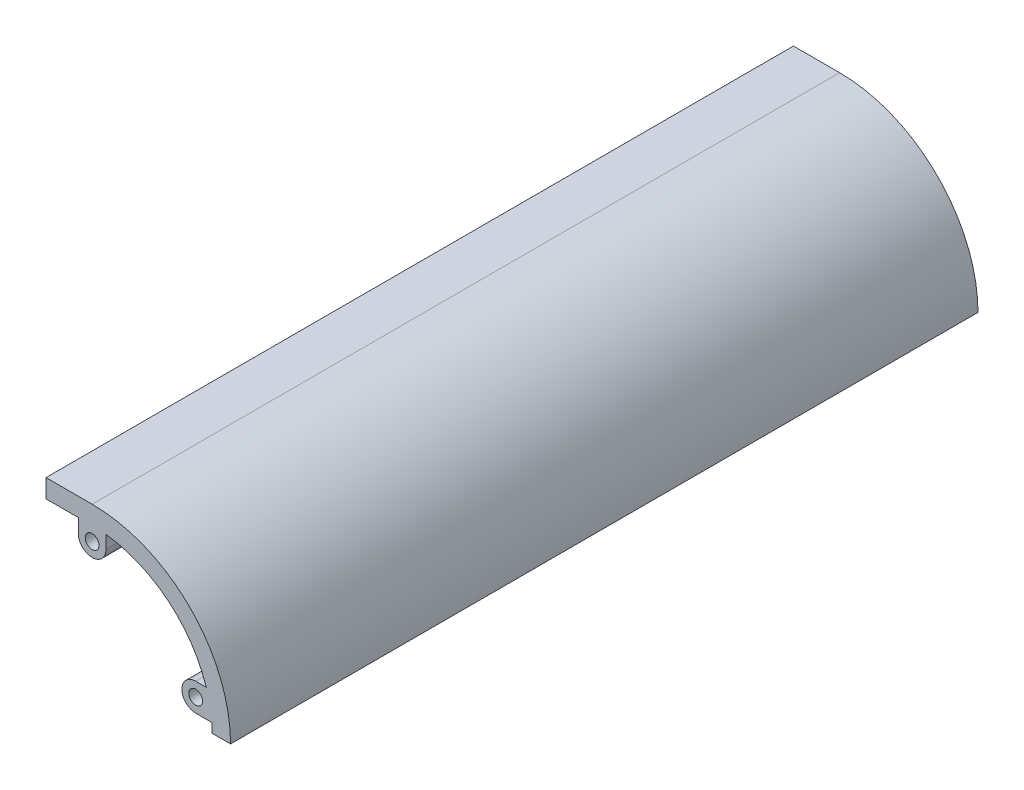
ISO-10303-21;
HEADER;
FILE_DESCRIPTION(('STEP AP214'),'2;1');
FILE_NAME('part.step','',(''),(''),'','','');
FILE_SCHEMA(('AUTOMOTIVE_DESIGN { 1 0 10303 214 1 1 1 1 }'));
ENDSEC;
DATA;
#1=APPLICATION_CONTEXT('core data for automotive mechanical design processes');
#2=APPLICATION_PROTOCOL_DEFINITION('international standard','automotive_design',2000,#1);
#3=PRODUCT_CONTEXT('',#1,'mechanical');
#4=PRODUCT('Part','Part','',(#3));
#5=PRODUCT_RELATED_PRODUCT_CATEGORY('part','',(#4));
#6=PRODUCT_DEFINITION_FORMATION('','',#4);
#7=PRODUCT_DEFINITION_CONTEXT('part definition',#1,'design');
#8=PRODUCT_DEFINITION('design','',#6,#7);
#9=PRODUCT_DEFINITION_SHAPE('','',#8);
#10=(LENGTH_UNIT() NAMED_UNIT(*) SI_UNIT(.MILLI.,.METRE.));
#11=(NAMED_UNIT(*) PLANE_ANGLE_UNIT() SI_UNIT($,.RADIAN.));
#12=(NAMED_UNIT(*) SI_UNIT($,.STERADIAN.) SOLID_ANGLE_UNIT());
#13=UNCERTAINTY_MEASURE_WITH_UNIT(LENGTH_MEASURE(1.E-05),#10,'distance_accuracy_value','');
#14=(GEOMETRIC_REPRESENTATION_CONTEXT(3) GLOBAL_UNCERTAINTY_ASSIGNED_CONTEXT((#13)) GLOBAL_UNIT_ASSIGNED_CONTEXT((#10,
#11,#12)) REPRESENTATION_CONTEXT('',''));
#15=CARTESIAN_POINT('',(0.,0.,0.));
#16=DIRECTION('',(0.,0.,1.));
#17=DIRECTION('',(1.,0.,0.));
#18=AXIS2_PLACEMENT_3D('',#15,#16,#17);
#19=CARTESIAN_POINT('',(-6.31578947368421,9.39473684210527,162.));
#20=DIRECTION('',(1.,0.,0.));
#21=DIRECTION('',(0.,0.,-1.));
#22=AXIS2_PLACEMENT_3D('',#19,#20,#21);
#23=PLANE('',#22);
#24=DIRECTION('',(0.,-1.,0.));
#25=VECTOR('',#24,1.);
#26=CARTESIAN_POINT('',(-6.31578947368421,9.39473684210527,5.));
#27=LINE('',#26,#25);
#28=CARTESIAN_POINT('',(-6.31578947368421,12.3947368421053,5.));
#29=VERTEX_POINT('',#28);
#30=CARTESIAN_POINT('',(-6.31578947368421,9.39473684210527,5.));
#31=VERTEX_POINT('',#30);
#32=EDGE_CURVE('E244',#29,#31,#27,.T.);
#33=ORIENTED_EDGE('',*,*,#32,.F.);
#34=DIRECTION('',(0.,0.,-1.));
#35=VECTOR('',#34,1.);
#36=CARTESIAN_POINT('',(-6.31578947368421,12.3947368421053,162.));
#37=LINE('',#36,#35);
#38=CARTESIAN_POINT('',(-6.31578947368421,12.3947368421053,0.));
#39=VERTEX_POINT('',#38);
#40=EDGE_CURVE('E208',#29,#39,#37,.T.);
#41=ORIENTED_EDGE('',*,*,#40,.T.);
#42=DIRECTION('',(0.,-1.,0.));
#43=VECTOR('',#42,1.);
#44=CARTESIAN_POINT('',(-6.31578947368421,9.39473684210527,0.));
#45=LINE('',#44,#43);
#46=CARTESIAN_POINT('',(-6.31578947368421,9.39473684210527,0.));
#47=VERTEX_POINT('',#46);
#48=EDGE_CURVE('E292',#39,#47,#45,.T.);
#49=ORIENTED_EDGE('',*,*,#48,.T.);
#50=DIRECTION('',(0.,0.,-1.));
#51=VECTOR('',#50,1.);
#52=CARTESIAN_POINT('',(-6.31578947368421,9.39473684210527,162.));
#53=LINE('',#52,#51);
#54=EDGE_CURVE('E353',#31,#47,#53,.T.);
#55=ORIENTED_EDGE('',*,*,#54,.F.);
#56=EDGE_LOOP('',(#33,#41,#49,#55));
#57=FACE_BOUND('',#56,.T.);
#58=ADVANCED_FACE('F34',(#57),#23,.F.);
#59=CARTESIAN_POINT('',(-3.31578947368421,9.39473684210527,162.));
#60=DIRECTION('',(0.,0.,-1.));
#61=DIRECTION('',(-1.,0.,0.));
#62=AXIS2_PLACEMENT_3D('',#59,#60,#61);
#63=CYLINDRICAL_SURFACE('',#62,3.);
#64=CARTESIAN_POINT('',(-3.31578947368421,9.39473684210527,5.));
#65=DIRECTION('',(0.,0.,1.));
#66=DIRECTION('',(1.,0.,0.));
#67=AXIS2_PLACEMENT_3D('',#64,#65,#66);
#68=CIRCLE('',#67,3.);
#69=CARTESIAN_POINT('',(-0.315789473684206,9.39473684210527,5.));
#70=VERTEX_POINT('',#69);
#71=EDGE_CURVE('E242',#31,#70,#68,.T.);
#72=ORIENTED_EDGE('',*,*,#71,.F.);
#73=ORIENTED_EDGE('',*,*,#54,.T.);
#74=CARTESIAN_POINT('',(-3.31578947368421,9.39473684210527,0.));
#75=DIRECTION('',(0.,0.,1.));
#76=DIRECTION('',(1.,0.,0.));
#77=AXIS2_PLACEMENT_3D('',#74,#75,#76);
#78=CIRCLE('',#77,3.);
#79=CARTESIAN_POINT('',(-0.315789473684206,9.39473684210527,0.));
#80=VERTEX_POINT('',#79);
#81=EDGE_CURVE('E295',#47,#80,#78,.T.);
#82=ORIENTED_EDGE('',*,*,#81,.T.);
#83=DIRECTION('',(0.,0.,-1.));
#84=VECTOR('',#83,1.);
#85=CARTESIAN_POINT('',(-0.315789473684206,9.39473684210527,162.));
#86=LINE('',#85,#84);
#87=EDGE_CURVE('E349',#70,#80,#86,.T.);
#88=ORIENTED_EDGE('',*,*,#87,.F.);
#89=EDGE_LOOP('',(#72,#73,#82,#88));
#90=FACE_BOUND('',#89,.T.);
#91=ADVANCED_FACE('F388',(#90),#63,.T.);
#92=CARTESIAN_POINT('',(-0.315789473684206,9.39473684210527,162.));
#93=DIRECTION('',(-1.,0.,0.));
#94=DIRECTION('',(0.,0.,1.));
#95=AXIS2_PLACEMENT_3D('',#92,#93,#94);
#96=PLANE('',#95);
#97=DIRECTION('',(0.,1.,0.));
#98=VECTOR('',#97,1.);
#99=CARTESIAN_POINT('',(-0.315789473684206,9.39473684210527,5.));
#100=LINE('',#99,#98);
#101=CARTESIAN_POINT('',(-0.315789473684206,12.2210799823952,5.));
#102=VERTEX_POINT('',#101);
#103=EDGE_CURVE('E190',#70,#102,#100,.T.);
#104=ORIENTED_EDGE('',*,*,#103,.F.);
#105=ORIENTED_EDGE('',*,*,#87,.T.);
#106=DIRECTION('',(0.,1.,0.));
#107=VECTOR('',#106,1.);
#108=CARTESIAN_POINT('',(-0.315789473684206,9.39473684210527,0.));
#109=LINE('',#108,#107);
#110=CARTESIAN_POINT('',(-0.315789473684206,12.2210799823952,0.));
#111=VERTEX_POINT('',#110);
#112=EDGE_CURVE('E298',#80,#111,#109,.T.);
#113=ORIENTED_EDGE('',*,*,#112,.T.);
#114=DIRECTION('',(0.,0.,-1.));
#115=VECTOR('',#114,1.);
#116=CARTESIAN_POINT('',(-0.315789473684206,12.2210799823952,162.));
#117=LINE('',#116,#115);
#118=EDGE_CURVE('E346',#102,#111,#117,.T.);
#119=ORIENTED_EDGE('',*,*,#118,.F.);
#120=EDGE_LOOP('',(#104,#105,#113,#119));
#121=FACE_BOUND('',#120,.T.);
#122=ADVANCED_FACE('F395',(#121),#96,.F.);
#123=CARTESIAN_POINT('',(19.1341548469594,-5.60526315789473,162.));
#124=DIRECTION('',(0.,-1.,0.));
#125=DIRECTION('',(1.,0.,0.));
#126=AXIS2_PLACEMENT_3D('',#123,#124,#125);
#127=PLANE('',#126);
#128=DIRECTION('',(-1.,0.,0.));
#129=VECTOR('',#128,1.);
#130=CARTESIAN_POINT('',(19.1341548469594,-5.60526315789473,5.));
#131=LINE('',#130,#129);
#132=CARTESIAN_POINT('',(21.4228442800218,-5.60526315789473,5.));
#133=VERTEX_POINT('',#132);
#134=CARTESIAN_POINT('',(19.1341548469594,-5.60526315789473,5.));
#135=VERTEX_POINT('',#134);
#136=EDGE_CURVE('E239',#133,#135,#131,.T.);
#137=ORIENTED_EDGE('',*,*,#136,.F.);
#138=DIRECTION('',(0.,0.,-1.));
#139=VECTOR('',#138,1.);
#140=CARTESIAN_POINT('',(21.4228442800218,-5.60526315789473,162.));
#141=LINE('',#140,#139);
#142=CARTESIAN_POINT('',(21.4228442800218,-5.60526315789473,0.));
#143=VERTEX_POINT('',#142);
#144=EDGE_CURVE('E342',#133,#143,#141,.T.);
#145=ORIENTED_EDGE('',*,*,#144,.T.);
#146=DIRECTION('',(-1.,0.,0.));
#147=VECTOR('',#146,1.);
#148=CARTESIAN_POINT('',(19.1341548469594,-5.60526315789473,0.));
#149=LINE('',#148,#147);
#150=CARTESIAN_POINT('',(19.1341548469594,-5.60526315789473,0.));
#151=VERTEX_POINT('',#150);
#152=EDGE_CURVE('E304',#143,#151,#149,.T.);
#153=ORIENTED_EDGE('',*,*,#152,.T.);
#154=DIRECTION('',(0.,0.,-1.));
#155=VECTOR('',#154,1.);
#156=CARTESIAN_POINT('',(19.1341548469594,-5.60526315789473,162.));
#157=LINE('',#156,#155);
#158=EDGE_CURVE('E338',#135,#151,#157,.T.);
#159=ORIENTED_EDGE('',*,*,#158,.F.);
#160=EDGE_LOOP('',(#137,#145,#153,#159));
#161=FACE_BOUND('',#160,.T.);
#162=ADVANCED_FACE('F443',(#161),#127,.F.);
#163=CARTESIAN_POINT('',(19.1341548469594,-8.60526315789473,162.));
#164=DIRECTION('',(0.,0.,-1.));
#165=DIRECTION('',(-1.,0.,0.));
#166=AXIS2_PLACEMENT_3D('',#163,#164,#165);
#167=CYLINDRICAL_SURFACE('',#166,3.);
#168=CARTESIAN_POINT('',(19.1341548469594,-8.60526315789473,5.));
#169=DIRECTION('',(0.,0.,1.));
#170=DIRECTION('',(1.,0.,0.));
#171=AXIS2_PLACEMENT_3D('',#168,#169,#170);
#172=CIRCLE('',#171,3.);
#173=CARTESIAN_POINT('',(19.1341548469594,-11.6052631578947,5.));
#174=VERTEX_POINT('',#173);
#175=EDGE_CURVE('E237',#135,#174,#172,.T.);
#176=ORIENTED_EDGE('',*,*,#175,.F.);
#177=ORIENTED_EDGE('',*,*,#158,.T.);
#178=CARTESIAN_POINT('',(19.1341548469594,-8.60526315789473,0.));
#179=DIRECTION('',(0.,0.,1.));
#180=DIRECTION('',(1.,0.,0.));
#181=AXIS2_PLACEMENT_3D('',#178,#179,#180);
#182=CIRCLE('',#181,3.);
#183=CARTESIAN_POINT('',(19.1341548469594,-11.6052631578947,0.));
#184=VERTEX_POINT('',#183);
#185=EDGE_CURVE('E307',#151,#184,#182,.T.);
#186=ORIENTED_EDGE('',*,*,#185,.T.);
#187=DIRECTION('',(0.,0.,-1.));
#188=VECTOR('',#187,1.);
#189=CARTESIAN_POINT('',(19.1341548469594,-11.6052631578947,162.));
#190=LINE('',#189,#188);
#191=EDGE_CURVE('E334',#174,#184,#190,.T.);
#192=ORIENTED_EDGE('',*,*,#191,.F.);
#193=EDGE_LOOP('',(#176,#177,#186,#192));
#194=FACE_BOUND('',#193,.T.);
#195=ADVANCED_FACE('F450',(#194),#167,.T.);
#196=CARTESIAN_POINT('',(19.1341548469594,-11.6052631578947,162.));
#197=DIRECTION('',(0.,1.,0.));
#198=DIRECTION('',(-1.,0.,0.));
#199=AXIS2_PLACEMENT_3D('',#196,#197,#198);
#200=PLANE('',#199);
#201=DIRECTION('',(1.,0.,0.));
#202=VECTOR('',#201,1.);
#203=CARTESIAN_POINT('',(19.1341548469594,-11.6052631578947,5.));
#204=LINE('',#203,#202);
#205=CARTESIAN_POINT('',(22.6071733199472,-11.6052631578947,5.));
#206=VERTEX_POINT('',#205);
#207=EDGE_CURVE('E235',#174,#206,#204,.T.);
#208=ORIENTED_EDGE('',*,*,#207,.F.);
#209=ORIENTED_EDGE('',*,*,#191,.T.);
#210=DIRECTION('',(1.,0.,0.));
#211=VECTOR('',#210,1.);
#212=CARTESIAN_POINT('',(19.1341548469594,-11.6052631578947,0.));
#213=LINE('',#212,#211);
#214=CARTESIAN_POINT('',(22.6071733199472,-11.6052631578947,0.));
#215=VERTEX_POINT('',#214);
#216=EDGE_CURVE('E310',#184,#215,#213,.T.);
#217=ORIENTED_EDGE('',*,*,#216,.T.);
#218=DIRECTION('',(0.,0.,-1.));
#219=VECTOR('',#218,1.);
#220=CARTESIAN_POINT('',(22.6071733199472,-11.6052631578947,162.));
#221=LINE('',#220,#219);
#222=EDGE_CURVE('E331',#206,#215,#221,.T.);
#223=ORIENTED_EDGE('',*,*,#222,.F.);
#224=EDGE_LOOP('',(#208,#209,#217,#223));
#225=FACE_BOUND('',#224,.T.);
#226=ADVANCED_FACE('F452',(#225),#200,.F.);
#227=CARTESIAN_POINT('',(-3.31578947368421,9.39473684210527,162.));
#228=DIRECTION('',(0.,0.,-1.));
#229=DIRECTION('',(-1.,0.,0.));
#230=AXIS2_PLACEMENT_3D('',#227,#228,#229);
#231=CYLINDRICAL_SURFACE('',#230,1.5);
#232=CARTESIAN_POINT('',(-3.31578947368421,9.39473684210527,0.));
#233=DIRECTION('',(0.,0.,1.));
#234=DIRECTION('',(1.,0.,0.));
#235=AXIS2_PLACEMENT_3D('',#232,#233,#234);
#236=CIRCLE('',#235,1.5);
#237=CARTESIAN_POINT('',(-1.81578947368421,9.39473684210527,0.));
#238=VERTEX_POINT('',#237);
#239=EDGE_CURVE('E250',#238,#238,#236,.T.);
#240=ORIENTED_EDGE('',*,*,#239,.F.);
#241=EDGE_LOOP('',(#240));
#242=FACE_BOUND('',#241,.T.);
#243=CARTESIAN_POINT('',(-3.31578947368421,9.39473684210527,5.));
#244=DIRECTION('',(0.,0.,1.));
#245=DIRECTION('',(1.,0.,0.));
#246=AXIS2_PLACEMENT_3D('',#243,#244,#245);
#247=CIRCLE('',#246,1.5);
#248=CARTESIAN_POINT('',(-1.81578947368421,9.39473684210527,5.));
#249=VERTEX_POINT('',#248);
#250=EDGE_CURVE('E232',#249,#249,#247,.T.);
#251=ORIENTED_EDGE('',*,*,#250,.T.);
#252=EDGE_LOOP('',(#251));
#253=FACE_BOUND('',#252,.T.);
#254=ADVANCED_FACE('F382',(#242,#253),#231,.F.);
#255=CARTESIAN_POINT('',(19.1341548469594,-8.60526315789473,162.));
#256=DIRECTION('',(0.,0.,-1.));
#257=DIRECTION('',(-1.,0.,0.));
#258=AXIS2_PLACEMENT_3D('',#255,#256,#257);
#259=CYLINDRICAL_SURFACE('',#258,1.5);
#260=CARTESIAN_POINT('',(19.1341548469594,-8.60526315789473,0.));
#261=DIRECTION('',(0.,0.,1.));
#262=DIRECTION('',(1.,0.,0.));
#263=AXIS2_PLACEMENT_3D('',#260,#261,#262);
#264=CIRCLE('',#263,1.5);
#265=CARTESIAN_POINT('',(20.6341548469594,-8.60526315789473,0.));
#266=VERTEX_POINT('',#265);
#267=EDGE_CURVE('E246',#266,#266,#264,.T.);
#268=ORIENTED_EDGE('',*,*,#267,.F.);
#269=EDGE_LOOP('',(#268));
#270=FACE_BOUND('',#269,.T.);
#271=CARTESIAN_POINT('',(19.1341548469594,-8.60526315789473,5.));
#272=DIRECTION('',(0.,0.,1.));
#273=DIRECTION('',(1.,0.,0.));
#274=AXIS2_PLACEMENT_3D('',#271,#272,#273);
#275=CIRCLE('',#274,1.5);
#276=CARTESIAN_POINT('',(20.6341548469594,-8.60526315789473,5.));
#277=VERTEX_POINT('',#276);
#278=EDGE_CURVE('E38',#277,#277,#275,.T.);
#279=ORIENTED_EDGE('',*,*,#278,.T.);
#280=EDGE_LOOP('',(#279));
#281=FACE_BOUND('',#280,.T.);
#282=ADVANCED_FACE('F368',(#270,#281),#259,.F.);
#283=CARTESIAN_POINT('',(-3.31578947368421,9.39473684210527,162.));
#284=DIRECTION('',(0.,0.,1.));
#285=DIRECTION('',(1.,0.,0.));
#286=AXIS2_PLACEMENT_3D('',#283,#284,#285);
#287=PLANE('',#286);
#288=CARTESIAN_POINT('',(-3.31578947368421,9.39473684210527,162.));
#289=DIRECTION('',(0.,0.,1.));
#290=DIRECTION('',(1.,0.,0.));
#291=AXIS2_PLACEMENT_3D('',#288,#289,#290);
#292=CIRCLE('',#291,1.5);
#293=CARTESIAN_POINT('',(-1.81578947368421,9.39473684210527,162.));
#294=VERTEX_POINT('',#293);
#295=EDGE_CURVE('E253',#294,#294,#292,.T.);
#296=ORIENTED_EDGE('',*,*,#295,.F.);
#297=EDGE_LOOP('',(#296));
#298=FACE_BOUND('',#297,.T.);
#299=DIRECTION('',(0.,-1.,0.));
#300=VECTOR('',#299,1.);
#301=CARTESIAN_POINT('',(-13.3157894736842,16.3947368421053,162.));
#302=LINE('',#301,#300);
#303=CARTESIAN_POINT('',(-13.3157894736842,16.3947368421053,162.));
#304=VERTEX_POINT('',#303);
#305=CARTESIAN_POINT('',(-13.3157894736842,12.3947368421053,162.));
#306=VERTEX_POINT('',#305);
#307=EDGE_CURVE('E259',#304,#306,#302,.T.);
#308=ORIENTED_EDGE('',*,*,#307,.T.);
#309=DIRECTION('',(1.,0.,0.));
#310=VECTOR('',#309,1.);
#311=CARTESIAN_POINT('',(-13.3157894736842,12.3947368421053,162.));
#312=LINE('',#311,#310);
#313=CARTESIAN_POINT('',(-6.31578947368421,12.3947368421053,162.));
#314=VERTEX_POINT('',#313);
#315=EDGE_CURVE('E262',#306,#314,#312,.T.);
#316=ORIENTED_EDGE('',*,*,#315,.T.);
#317=DIRECTION('',(0.,-1.,0.));
#318=VECTOR('',#317,1.);
#319=CARTESIAN_POINT('',(-6.31578947368421,9.39473684210527,162.));
#320=LINE('',#319,#318);
#321=CARTESIAN_POINT('',(-6.31578947368421,9.39473684210527,162.));
#322=VERTEX_POINT('',#321);
#323=EDGE_CURVE('E265',#314,#322,#320,.T.);
#324=ORIENTED_EDGE('',*,*,#323,.T.);
#325=CARTESIAN_POINT('',(-3.31578947368421,9.39473684210527,162.));
#326=DIRECTION('',(0.,0.,1.));
#327=DIRECTION('',(1.,0.,0.));
#328=AXIS2_PLACEMENT_3D('',#325,#326,#327);
#329=CIRCLE('',#328,3.);
#330=CARTESIAN_POINT('',(-0.315789473684206,9.39473684210527,162.));
#331=VERTEX_POINT('',#330);
#332=EDGE_CURVE('E267',#322,#331,#329,.T.);
#333=ORIENTED_EDGE('',*,*,#332,.T.);
#334=DIRECTION('',(0.,1.,0.));
#335=VECTOR('',#334,1.);
#336=CARTESIAN_POINT('',(-0.315789473684206,9.39473684210527,162.));
#337=LINE('',#336,#335);
#338=CARTESIAN_POINT('',(-0.315789473684206,12.2210799823952,162.));
#339=VERTEX_POINT('',#338);
#340=EDGE_CURVE('E269',#331,#339,#337,.T.);
#341=ORIENTED_EDGE('',*,*,#340,.T.);
#342=CARTESIAN_POINT('',(-3.31578947368421,-13.6052631578947,162.));
#343=DIRECTION('',(0.,0.,-1.));
#344=DIRECTION('',(1.,0.,0.));
#345=AXIS2_PLACEMENT_3D('',#342,#343,#344);
#346=CIRCLE('',#345,26.);
#347=CARTESIAN_POINT('',(21.4228442800218,-5.60526315789473,162.));
#348=VERTEX_POINT('',#347);
#349=EDGE_CURVE('E271',#339,#348,#346,.T.);
#350=ORIENTED_EDGE('',*,*,#349,.T.);
#351=DIRECTION('',(-1.,0.,0.));
#352=VECTOR('',#351,1.);
#353=CARTESIAN_POINT('',(19.1341548469594,-5.60526315789473,162.));
#354=LINE('',#353,#352);
#355=CARTESIAN_POINT('',(19.1341548469594,-5.60526315789473,162.));
#356=VERTEX_POINT('',#355);
#357=EDGE_CURVE('E273',#348,#356,#354,.T.);
#358=ORIENTED_EDGE('',*,*,#357,.T.);
#359=CARTESIAN_POINT('',(19.1341548469594,-8.60526315789473,162.));
#360=DIRECTION('',(0.,0.,1.));
#361=DIRECTION('',(1.,0.,0.));
#362=AXIS2_PLACEMENT_3D('',#359,#360,#361);
#363=CIRCLE('',#362,3.);
#364=CARTESIAN_POINT('',(19.1341548469594,-11.6052631578947,162.));
#365=VERTEX_POINT('',#364);
#366=EDGE_CURVE('E275',#356,#365,#363,.T.);
#367=ORIENTED_EDGE('',*,*,#366,.T.);
#368=DIRECTION('',(1.,0.,0.));
#369=VECTOR('',#368,1.);
#370=CARTESIAN_POINT('',(19.1341548469594,-11.6052631578947,162.));
#371=LINE('',#370,#369);
#372=CARTESIAN_POINT('',(22.6071733199472,-11.6052631578947,162.));
#373=VERTEX_POINT('',#372);
#374=EDGE_CURVE('E277',#365,#373,#371,.T.);
#375=ORIENTED_EDGE('',*,*,#374,.T.);
#376=CARTESIAN_POINT('',(-3.31578947368421,-13.6052631578947,162.));
#377=DIRECTION('',(0.,0.,-1.));
#378=DIRECTION('',(1.,0.,0.));
#379=AXIS2_PLACEMENT_3D('',#376,#377,#378);
#380=CIRCLE('',#379,26.);
#381=CARTESIAN_POINT('',(22.6842105263158,-13.6052631578947,162.));
#382=VERTEX_POINT('',#381);
#383=EDGE_CURVE('E279',#373,#382,#380,.T.);
#384=ORIENTED_EDGE('',*,*,#383,.T.);
#385=DIRECTION('',(1.,0.,0.));
#386=VECTOR('',#385,1.);
#387=CARTESIAN_POINT('',(22.6842105263158,-13.6052631578947,162.));
#388=LINE('',#387,#386);
#389=CARTESIAN_POINT('',(26.6842105263158,-13.6052631578947,162.));
#390=VERTEX_POINT('',#389);
#391=EDGE_CURVE('E281',#382,#390,#388,.T.);
#392=ORIENTED_EDGE('',*,*,#391,.T.);
#393=CARTESIAN_POINT('',(-3.31578947368421,-13.6052631578947,162.));
#394=DIRECTION('',(0.,0.,1.));
#395=DIRECTION('',(1.,0.,0.));
#396=AXIS2_PLACEMENT_3D('',#393,#394,#395);
#397=CIRCLE('',#396,30.);
#398=CARTESIAN_POINT('',(-3.31578947368421,16.3947368421053,162.));
#399=VERTEX_POINT('',#398);
#400=EDGE_CURVE('E283',#390,#399,#397,.T.);
#401=ORIENTED_EDGE('',*,*,#400,.T.);
#402=DIRECTION('',(-1.,0.,0.));
#403=VECTOR('',#402,1.);
#404=CARTESIAN_POINT('',(-13.3157894736842,16.3947368421053,162.));
#405=LINE('',#404,#403);
#406=EDGE_CURVE('E285',#399,#304,#405,.T.);
#407=ORIENTED_EDGE('',*,*,#406,.T.);
#408=EDGE_LOOP('',(#308,#316,#324,#333,#341,#350,#358,#367,#375,#384,#392,#401,#407));
#409=FACE_BOUND('',#408,.T.);
#410=CARTESIAN_POINT('',(19.1341548469594,-8.60526315789473,162.));
#411=DIRECTION('',(0.,0.,1.));
#412=DIRECTION('',(1.,0.,0.));
#413=AXIS2_PLACEMENT_3D('',#410,#411,#412);
#414=CIRCLE('',#413,1.5);
#415=CARTESIAN_POINT('',(20.6341548469594,-8.60526315789473,162.));
#416=VERTEX_POINT('',#415);
#417=EDGE_CURVE('E247',#416,#416,#414,.T.);
#418=ORIENTED_EDGE('',*,*,#417,.F.);
#419=EDGE_LOOP('',(#418));
#420=FACE_BOUND('',#419,.T.);
#421=ADVANCED_FACE('F371',(#298,#409,#420),#287,.T.);
#422=CARTESIAN_POINT('',(-3.31578947368421,9.39473684210527,0.));
#423=DIRECTION('',(0.,0.,1.));
#424=DIRECTION('',(1.,0.,0.));
#425=AXIS2_PLACEMENT_3D('',#422,#423,#424);
#426=PLANE('',#425);
#427=DIRECTION('',(0.,-1.,0.));
#428=VECTOR('',#427,1.);
#429=CARTESIAN_POINT('',(-13.3157894736842,16.3947368421053,0.));
#430=LINE('',#429,#428);
#431=CARTESIAN_POINT('',(-13.3157894736842,16.3947368421053,0.));
#432=VERTEX_POINT('',#431);
#433=CARTESIAN_POINT('',(-13.3157894736842,12.3947368421053,0.));
#434=VERTEX_POINT('',#433);
#435=EDGE_CURVE('E256',#432,#434,#430,.T.);
#436=ORIENTED_EDGE('',*,*,#435,.F.);
#437=DIRECTION('',(-1.,0.,0.));
#438=VECTOR('',#437,1.);
#439=CARTESIAN_POINT('',(-13.3157894736842,16.3947368421053,0.));
#440=LINE('',#439,#438);
#441=CARTESIAN_POINT('',(-3.31578947368421,16.3947368421053,0.));
#442=VERTEX_POINT('',#441);
#443=EDGE_CURVE('E263',#442,#432,#440,.T.);
#444=ORIENTED_EDGE('',*,*,#443,.F.);
#445=CARTESIAN_POINT('',(-3.31578947368421,-13.6052631578947,0.));
#446=DIRECTION('',(0.,0.,1.));
#447=DIRECTION('',(1.,0.,0.));
#448=AXIS2_PLACEMENT_3D('',#445,#446,#447);
#449=CIRCLE('',#448,30.);
#450=CARTESIAN_POINT('',(26.6842105263158,-13.6052631578947,0.));
#451=VERTEX_POINT('',#450);
#452=EDGE_CURVE('E318',#451,#442,#449,.T.);
#453=ORIENTED_EDGE('',*,*,#452,.F.);
#454=DIRECTION('',(1.,0.,0.));
#455=VECTOR('',#454,1.);
#456=CARTESIAN_POINT('',(22.6842105263158,-13.6052631578947,0.));
#457=LINE('',#456,#455);
#458=CARTESIAN_POINT('',(22.6842105263158,-13.6052631578947,0.));
#459=VERTEX_POINT('',#458);
#460=EDGE_CURVE('E316',#459,#451,#457,.T.);
#461=ORIENTED_EDGE('',*,*,#460,.F.);
#462=CARTESIAN_POINT('',(-3.31578947368421,-13.6052631578947,0.));
#463=DIRECTION('',(0.,0.,-1.));
#464=DIRECTION('',(1.,0.,0.));
#465=AXIS2_PLACEMENT_3D('',#462,#463,#464);
#466=CIRCLE('',#465,26.);
#467=EDGE_CURVE('E313',#215,#459,#466,.T.);
#468=ORIENTED_EDGE('',*,*,#467,.F.);
#469=ORIENTED_EDGE('',*,*,#216,.F.);
#470=ORIENTED_EDGE('',*,*,#185,.F.);
#471=ORIENTED_EDGE('',*,*,#152,.F.);
#472=CARTESIAN_POINT('',(-3.31578947368421,-13.6052631578947,0.));
#473=DIRECTION('',(0.,0.,-1.));
#474=DIRECTION('',(1.,0.,0.));
#475=AXIS2_PLACEMENT_3D('',#472,#473,#474);
#476=CIRCLE('',#475,26.);
#477=EDGE_CURVE('E301',#111,#143,#476,.T.);
#478=ORIENTED_EDGE('',*,*,#477,.F.);
#479=ORIENTED_EDGE('',*,*,#112,.F.);
#480=ORIENTED_EDGE('',*,*,#81,.F.);
#481=ORIENTED_EDGE('',*,*,#48,.F.);
#482=DIRECTION('',(1.,0.,0.));
#483=VECTOR('',#482,1.);
#484=CARTESIAN_POINT('',(-13.3157894736842,12.3947368421053,0.));
#485=LINE('',#484,#483);
#486=EDGE_CURVE('E290',#434,#39,#485,.T.);
#487=ORIENTED_EDGE('',*,*,#486,.F.);
#488=EDGE_LOOP('',(#436,#444,#453,#461,#468,#469,#470,#471,#478,#479,#480,#481,#487));
#489=FACE_BOUND('',#488,.T.);
#490=ORIENTED_EDGE('',*,*,#239,.T.);
#491=EDGE_LOOP('',(#490));
#492=FACE_BOUND('',#491,.T.);
#493=ORIENTED_EDGE('',*,*,#267,.T.);
#494=EDGE_LOOP('',(#493));
#495=FACE_BOUND('',#494,.T.);
#496=ADVANCED_FACE('F373',(#489,#492,#495),#426,.F.);
#497=CARTESIAN_POINT('',(-13.3157894736842,16.3947368421053,162.));
#498=DIRECTION('',(1.,0.,0.));
#499=DIRECTION('',(0.,0.,-1.));
#500=AXIS2_PLACEMENT_3D('',#497,#498,#499);
#501=PLANE('',#500);
#502=ORIENTED_EDGE('',*,*,#435,.T.);
#503=DIRECTION('',(0.,0.,-1.));
#504=VECTOR('',#503,1.);
#505=CARTESIAN_POINT('',(-13.3157894736842,12.3947368421053,162.));
#506=LINE('',#505,#504);
#507=EDGE_CURVE('E11',#306,#434,#506,.T.);
#508=ORIENTED_EDGE('',*,*,#507,.F.);
#509=ORIENTED_EDGE('',*,*,#307,.F.);
#510=DIRECTION('',(0.,0.,-1.));
#511=VECTOR('',#510,1.);
#512=CARTESIAN_POINT('',(-13.3157894736842,16.3947368421053,162.));
#513=LINE('',#512,#511);
#514=EDGE_CURVE('E287',#304,#432,#513,.T.);
#515=ORIENTED_EDGE('',*,*,#514,.T.);
#516=EDGE_LOOP('',(#502,#508,#509,#515));
#517=FACE_BOUND('',#516,.T.);
#518=ADVANCED_FACE('F36',(#517),#501,.F.);
#519=CARTESIAN_POINT('',(-13.3157894736842,12.3947368421053,162.));
#520=DIRECTION('',(0.,1.,0.));
#521=DIRECTION('',(0.,0.,1.));
#522=AXIS2_PLACEMENT_3D('',#519,#520,#521);
#523=PLANE('',#522);
#524=ORIENTED_EDGE('',*,*,#507,.T.);
#525=ORIENTED_EDGE('',*,*,#486,.T.);
#526=ORIENTED_EDGE('',*,*,#40,.F.);
#527=DIRECTION('',(-1.,0.,0.));
#528=VECTOR('',#527,1.);
#529=CARTESIAN_POINT('',(-3.31578947368421,12.3947368421053,5.));
#530=LINE('',#529,#528);
#531=CARTESIAN_POINT('',(-3.31578947368421,12.3947368421053,5.));
#532=VERTEX_POINT('',#531);
#533=EDGE_CURVE('E187',#532,#29,#530,.T.);
#534=ORIENTED_EDGE('',*,*,#533,.F.);
#535=DIRECTION('',(0.,0.,1.));
#536=VECTOR('',#535,1.);
#537=CARTESIAN_POINT('',(-3.31578947368421,12.3947368421053,5.));
#538=LINE('',#537,#536);
#539=CARTESIAN_POINT('',(-3.31578947368421,12.3947368421053,157.));
#540=VERTEX_POINT('',#539);
#541=EDGE_CURVE('E197',#532,#540,#538,.T.);
#542=ORIENTED_EDGE('',*,*,#541,.T.);
#543=DIRECTION('',(-1.,0.,0.));
#544=VECTOR('',#543,1.);
#545=CARTESIAN_POINT('',(-3.31578947368421,12.3947368421053,157.));
#546=LINE('',#545,#544);
#547=CARTESIAN_POINT('',(-6.31578947368421,12.3947368421053,157.));
#548=VERTEX_POINT('',#547);
#549=EDGE_CURVE('E194',#540,#548,#546,.T.);
#550=ORIENTED_EDGE('',*,*,#549,.T.);
#551=EDGE_CURVE('E43',#314,#548,#37,.T.);
#552=ORIENTED_EDGE('',*,*,#551,.F.);
#553=ORIENTED_EDGE('',*,*,#315,.F.);
#554=EDGE_LOOP('',(#524,#525,#526,#534,#542,#550,#552,#553));
#555=FACE_BOUND('',#554,.T.);
#556=ADVANCED_FACE('F206',(#555),#523,.F.);
#557=ORIENTED_EDGE('',*,*,#551,.T.);
#558=DIRECTION('',(0.,-1.,0.));
#559=VECTOR('',#558,1.);
#560=CARTESIAN_POINT('',(-6.31578947368421,9.39473684210527,157.));
#561=LINE('',#560,#559);
#562=CARTESIAN_POINT('',(-6.31578947368421,9.39473684210527,157.));
#563=VERTEX_POINT('',#562);
#564=EDGE_CURVE('E229',#548,#563,#561,.T.);
#565=ORIENTED_EDGE('',*,*,#564,.T.);
#566=EDGE_CURVE('E354',#322,#563,#53,.T.);
#567=ORIENTED_EDGE('',*,*,#566,.F.);
#568=ORIENTED_EDGE('',*,*,#323,.F.);
#569=EDGE_LOOP('',(#557,#565,#567,#568));
#570=FACE_BOUND('',#569,.T.);
#571=ADVANCED_FACE('F391',(#570),#23,.F.);
#572=ORIENTED_EDGE('',*,*,#566,.T.);
#573=CARTESIAN_POINT('',(-3.31578947368421,9.39473684210527,157.));
#574=DIRECTION('',(0.,0.,1.));
#575=DIRECTION('',(1.,0.,0.));
#576=AXIS2_PLACEMENT_3D('',#573,#574,#575);
#577=CIRCLE('',#576,3.);
#578=CARTESIAN_POINT('',(-0.315789473684206,9.39473684210527,157.));
#579=VERTEX_POINT('',#578);
#580=EDGE_CURVE('E226',#563,#579,#577,.T.);
#581=ORIENTED_EDGE('',*,*,#580,.T.);
#582=EDGE_CURVE('E350',#331,#579,#86,.T.);
#583=ORIENTED_EDGE('',*,*,#582,.F.);
#584=ORIENTED_EDGE('',*,*,#332,.F.);
#585=EDGE_LOOP('',(#572,#581,#583,#584));
#586=FACE_BOUND('',#585,.T.);
#587=ADVANCED_FACE('F398',(#586),#63,.T.);
#588=ORIENTED_EDGE('',*,*,#582,.T.);
#589=DIRECTION('',(0.,1.,0.));
#590=VECTOR('',#589,1.);
#591=CARTESIAN_POINT('',(-0.315789473684206,9.39473684210527,157.));
#592=LINE('',#591,#590);
#593=CARTESIAN_POINT('',(-0.315789473684206,12.2210799823952,157.));
#594=VERTEX_POINT('',#593);
#595=EDGE_CURVE('E224',#579,#594,#592,.T.);
#596=ORIENTED_EDGE('',*,*,#595,.T.);
#597=EDGE_CURVE('E347',#339,#594,#117,.T.);
#598=ORIENTED_EDGE('',*,*,#597,.F.);
#599=ORIENTED_EDGE('',*,*,#340,.F.);
#600=EDGE_LOOP('',(#588,#596,#598,#599));
#601=FACE_BOUND('',#600,.T.);
#602=ADVANCED_FACE('F405',(#601),#96,.F.);
#603=CARTESIAN_POINT('',(21.4228442800218,-5.60526315789473,157.));
#604=VERTEX_POINT('',#603);
#605=EDGE_CURVE('E343',#348,#604,#141,.T.);
#606=ORIENTED_EDGE('',*,*,#605,.T.);
#607=DIRECTION('',(-1.,0.,0.));
#608=VECTOR('',#607,1.);
#609=CARTESIAN_POINT('',(19.1341548469594,-5.60526315789473,157.));
#610=LINE('',#609,#608);
#611=CARTESIAN_POINT('',(19.1341548469594,-5.60526315789473,157.));
#612=VERTEX_POINT('',#611);
#613=EDGE_CURVE('E221',#604,#612,#610,.T.);
#614=ORIENTED_EDGE('',*,*,#613,.T.);
#615=EDGE_CURVE('E339',#356,#612,#157,.T.);
#616=ORIENTED_EDGE('',*,*,#615,.F.);
#617=ORIENTED_EDGE('',*,*,#357,.F.);
#618=EDGE_LOOP('',(#606,#614,#616,#617));
#619=FACE_BOUND('',#618,.T.);
#620=ADVANCED_FACE('F478',(#619),#127,.F.);
#621=ORIENTED_EDGE('',*,*,#615,.T.);
#622=CARTESIAN_POINT('',(19.1341548469594,-8.60526315789473,157.));
#623=DIRECTION('',(0.,0.,1.));
#624=DIRECTION('',(1.,0.,0.));
#625=AXIS2_PLACEMENT_3D('',#622,#623,#624);
#626=CIRCLE('',#625,3.);
#627=CARTESIAN_POINT('',(19.1341548469594,-11.6052631578947,157.));
#628=VERTEX_POINT('',#627);
#629=EDGE_CURVE('E218',#612,#628,#626,.T.);
#630=ORIENTED_EDGE('',*,*,#629,.T.);
#631=EDGE_CURVE('E335',#365,#628,#190,.T.);
#632=ORIENTED_EDGE('',*,*,#631,.F.);
#633=ORIENTED_EDGE('',*,*,#366,.F.);
#634=EDGE_LOOP('',(#621,#630,#632,#633));
#635=FACE_BOUND('',#634,.T.);
#636=ADVANCED_FACE('F473',(#635),#167,.T.);
#637=ORIENTED_EDGE('',*,*,#631,.T.);
#638=DIRECTION('',(1.,0.,0.));
#639=VECTOR('',#638,1.);
#640=CARTESIAN_POINT('',(19.1341548469594,-11.6052631578947,157.));
#641=LINE('',#640,#639);
#642=CARTESIAN_POINT('',(22.6071733199472,-11.6052631578947,157.));
#643=VERTEX_POINT('',#642);
#644=EDGE_CURVE('E216',#628,#643,#641,.T.);
#645=ORIENTED_EDGE('',*,*,#644,.T.);
#646=EDGE_CURVE('E332',#373,#643,#221,.T.);
#647=ORIENTED_EDGE('',*,*,#646,.F.);
#648=ORIENTED_EDGE('',*,*,#374,.F.);
#649=EDGE_LOOP('',(#637,#645,#647,#648));
#650=FACE_BOUND('',#649,.T.);
#651=ADVANCED_FACE('F470',(#650),#200,.F.);
#652=CARTESIAN_POINT('',(-3.31578947368421,-13.6052631578947,162.));
#653=DIRECTION('',(0.,0.,-1.));
#654=DIRECTION('',(-1.,0.,0.));
#655=AXIS2_PLACEMENT_3D('',#652,#653,#654);
#656=CYLINDRICAL_SURFACE('',#655,26.);
#657=ORIENTED_EDGE('',*,*,#646,.T.);
#658=CARTESIAN_POINT('',(-3.31578947368421,-13.6052631578947,157.));
#659=DIRECTION('',(0.,0.,1.));
#660=DIRECTION('',(1.,0.,0.));
#661=AXIS2_PLACEMENT_3D('',#658,#659,#660);
#662=CIRCLE('',#661,26.);
#663=EDGE_CURVE('E59',#643,#604,#662,.T.);
#664=ORIENTED_EDGE('',*,*,#663,.T.);
#665=ORIENTED_EDGE('',*,*,#605,.F.);
#666=ORIENTED_EDGE('',*,*,#349,.F.);
#667=ORIENTED_EDGE('',*,*,#597,.T.);
#668=EDGE_CURVE('E51',#594,#540,#662,.T.);
#669=ORIENTED_EDGE('',*,*,#668,.T.);
#670=ORIENTED_EDGE('',*,*,#541,.F.);
#671=CARTESIAN_POINT('',(-3.31578947368421,-13.6052631578947,5.));
#672=DIRECTION('',(0.,0.,1.));
#673=DIRECTION('',(1.,0.,0.));
#674=AXIS2_PLACEMENT_3D('',#671,#672,#673);
#675=CIRCLE('',#674,26.);
#676=EDGE_CURVE('E183',#102,#532,#675,.T.);
#677=ORIENTED_EDGE('',*,*,#676,.F.);
#678=ORIENTED_EDGE('',*,*,#118,.T.);
#679=ORIENTED_EDGE('',*,*,#477,.T.);
#680=ORIENTED_EDGE('',*,*,#144,.F.);
#681=EDGE_CURVE('E193',#206,#133,#675,.T.);
#682=ORIENTED_EDGE('',*,*,#681,.F.);
#683=ORIENTED_EDGE('',*,*,#222,.T.);
#684=ORIENTED_EDGE('',*,*,#467,.T.);
#685=DIRECTION('',(0.,0.,-1.));
#686=VECTOR('',#685,1.);
#687=CARTESIAN_POINT('',(22.6842105263158,-13.6052631578947,162.));
#688=LINE('',#687,#686);
#689=EDGE_CURVE('E329',#382,#459,#688,.T.);
#690=ORIENTED_EDGE('',*,*,#689,.F.);
#691=ORIENTED_EDGE('',*,*,#383,.F.);
#692=EDGE_LOOP('',(#657,#664,#665,#666,#667,#669,#670,#677,#678,#679,#680,#682,#683,#684,#690,#691));
#693=FACE_BOUND('',#692,.T.);
#694=ADVANCED_FACE('F199',(#693),#656,.F.);
#695=CARTESIAN_POINT('',(22.6842105263158,-13.6052631578947,162.));
#696=DIRECTION('',(0.,1.,0.));
#697=DIRECTION('',(0.,0.,1.));
#698=AXIS2_PLACEMENT_3D('',#695,#696,#697);
#699=PLANE('',#698);
#700=ORIENTED_EDGE('',*,*,#460,.T.);
#701=DIRECTION('',(0.,0.,-1.));
#702=VECTOR('',#701,1.);
#703=CARTESIAN_POINT('',(26.6842105263158,-13.6052631578947,162.));
#704=LINE('',#703,#702);
#705=EDGE_CURVE('E326',#390,#451,#704,.T.);
#706=ORIENTED_EDGE('',*,*,#705,.F.);
#707=ORIENTED_EDGE('',*,*,#391,.F.);
#708=ORIENTED_EDGE('',*,*,#689,.T.);
#709=EDGE_LOOP('',(#700,#706,#707,#708));
#710=FACE_BOUND('',#709,.T.);
#711=ADVANCED_FACE('F462',(#710),#699,.F.);
#712=CARTESIAN_POINT('',(-3.31578947368421,-13.6052631578947,162.));
#713=DIRECTION('',(0.,0.,-1.));
#714=DIRECTION('',(-1.,0.,0.));
#715=AXIS2_PLACEMENT_3D('',#712,#713,#714);
#716=CYLINDRICAL_SURFACE('',#715,30.);
#717=ORIENTED_EDGE('',*,*,#452,.T.);
#718=DIRECTION('',(0.,0.,-1.));
#719=VECTOR('',#718,1.);
#720=CARTESIAN_POINT('',(-3.31578947368421,16.3947368421053,162.));
#721=LINE('',#720,#719);
#722=EDGE_CURVE('E323',#399,#442,#721,.T.);
#723=ORIENTED_EDGE('',*,*,#722,.F.);
#724=ORIENTED_EDGE('',*,*,#400,.F.);
#725=ORIENTED_EDGE('',*,*,#705,.T.);
#726=EDGE_LOOP('',(#717,#723,#724,#725));
#727=FACE_BOUND('',#726,.T.);
#728=ADVANCED_FACE('F465',(#727),#716,.T.);
#729=CARTESIAN_POINT('',(-13.3157894736842,16.3947368421053,162.));
#730=DIRECTION('',(0.,-1.,0.));
#731=DIRECTION('',(0.,0.,-1.));
#732=AXIS2_PLACEMENT_3D('',#729,#730,#731);
#733=PLANE('',#732);
#734=ORIENTED_EDGE('',*,*,#443,.T.);
#735=ORIENTED_EDGE('',*,*,#514,.F.);
#736=ORIENTED_EDGE('',*,*,#406,.F.);
#737=ORIENTED_EDGE('',*,*,#722,.T.);
#738=EDGE_LOOP('',(#734,#735,#736,#737));
#739=FACE_BOUND('',#738,.T.);
#740=ADVANCED_FACE('F508',(#739),#733,.F.);
#741=CARTESIAN_POINT('',(-3.31578947368421,9.39473684210527,157.));
#742=DIRECTION('',(0.,0.,1.));
#743=DIRECTION('',(1.,0.,0.));
#744=AXIS2_PLACEMENT_3D('',#741,#742,#743);
#745=CIRCLE('',#744,1.5);
#746=CARTESIAN_POINT('',(-1.81578947368421,9.39473684210527,157.));
#747=VERTEX_POINT('',#746);
#748=EDGE_CURVE('E213',#747,#747,#745,.T.);
#749=ORIENTED_EDGE('',*,*,#748,.F.);
#750=EDGE_LOOP('',(#749));
#751=FACE_BOUND('',#750,.T.);
#752=ORIENTED_EDGE('',*,*,#295,.T.);
#753=EDGE_LOOP('',(#752));
#754=FACE_BOUND('',#753,.T.);
#755=ADVANCED_FACE('F366',(#751,#754),#231,.F.);
#756=CARTESIAN_POINT('',(19.1341548469594,-8.60526315789473,157.));
#757=DIRECTION('',(0.,0.,1.));
#758=DIRECTION('',(1.,0.,0.));
#759=AXIS2_PLACEMENT_3D('',#756,#757,#758);
#760=CIRCLE('',#759,1.5);
#761=CARTESIAN_POINT('',(20.6341548469594,-8.60526315789473,157.));
#762=VERTEX_POINT('',#761);
#763=EDGE_CURVE('E203',#762,#762,#760,.T.);
#764=ORIENTED_EDGE('',*,*,#763,.F.);
#765=EDGE_LOOP('',(#764));
#766=FACE_BOUND('',#765,.T.);
#767=ORIENTED_EDGE('',*,*,#417,.T.);
#768=EDGE_LOOP('',(#767));
#769=FACE_BOUND('',#768,.T.);
#770=ADVANCED_FACE('F363',(#766,#769),#259,.F.);
#771=CARTESIAN_POINT('',(-3.31578947368421,-13.6052631578947,157.));
#772=DIRECTION('',(0.,0.,1.));
#773=DIRECTION('',(1.,0.,0.));
#774=AXIS2_PLACEMENT_3D('',#771,#772,#773);
#775=PLANE('',#774);
#776=ORIENTED_EDGE('',*,*,#763,.T.);
#777=EDGE_LOOP('',(#776));
#778=FACE_BOUND('',#777,.T.);
#779=ORIENTED_EDGE('',*,*,#663,.F.);
#780=ORIENTED_EDGE('',*,*,#644,.F.);
#781=ORIENTED_EDGE('',*,*,#629,.F.);
#782=ORIENTED_EDGE('',*,*,#613,.F.);
#783=EDGE_LOOP('',(#779,#780,#781,#782));
#784=FACE_BOUND('',#783,.T.);
#785=ADVANCED_FACE('F361',(#778,#784),#775,.F.);
#786=CARTESIAN_POINT('',(-3.31578947368421,-13.6052631578947,5.));
#787=DIRECTION('',(0.,0.,1.));
#788=DIRECTION('',(1.,0.,0.));
#789=AXIS2_PLACEMENT_3D('',#786,#787,#788);
#790=PLANE('',#789);
#791=ORIENTED_EDGE('',*,*,#278,.F.);
#792=EDGE_LOOP('',(#791));
#793=FACE_BOUND('',#792,.T.);
#794=ORIENTED_EDGE('',*,*,#136,.T.);
#795=ORIENTED_EDGE('',*,*,#175,.T.);
#796=ORIENTED_EDGE('',*,*,#207,.T.);
#797=ORIENTED_EDGE('',*,*,#681,.T.);
#798=EDGE_LOOP('',(#794,#795,#796,#797));
#799=FACE_BOUND('',#798,.T.);
#800=ADVANCED_FACE('F446',(#793,#799),#790,.T.);
#801=ORIENTED_EDGE('',*,*,#250,.F.);
#802=EDGE_LOOP('',(#801));
#803=FACE_BOUND('',#802,.T.);
#804=ORIENTED_EDGE('',*,*,#32,.T.);
#805=ORIENTED_EDGE('',*,*,#71,.T.);
#806=ORIENTED_EDGE('',*,*,#103,.T.);
#807=ORIENTED_EDGE('',*,*,#676,.T.);
#808=ORIENTED_EDGE('',*,*,#533,.T.);
#809=EDGE_LOOP('',(#804,#805,#806,#807,#808));
#810=FACE_BOUND('',#809,.T.);
#811=ADVANCED_FACE('F185',(#803,#810),#790,.T.);
#812=ORIENTED_EDGE('',*,*,#748,.T.);
#813=EDGE_LOOP('',(#812));
#814=FACE_BOUND('',#813,.T.);
#815=ORIENTED_EDGE('',*,*,#549,.F.);
#816=ORIENTED_EDGE('',*,*,#668,.F.);
#817=ORIENTED_EDGE('',*,*,#595,.F.);
#818=ORIENTED_EDGE('',*,*,#580,.F.);
#819=ORIENTED_EDGE('',*,*,#564,.F.);
#820=EDGE_LOOP('',(#815,#816,#817,#818,#819));
#821=FACE_BOUND('',#820,.T.);
#822=ADVANCED_FACE('F410',(#814,#821),#775,.F.);
#823=CLOSED_SHELL('',(#58,#91,#122,#162,#195,#226,#254,#282,#421,#496,#518,#556,#571,#587,#602,
#620,#636,#651,#694,#711,#728,#740,#755,#770,#785,#800,#811,#822));
#824=MANIFOLD_SOLID_BREP('B2',#823);
#825=ADVANCED_BREP_SHAPE_REPRESENTATION('',(#18,#824),#14);
#826=SHAPE_DEFINITION_REPRESENTATION(#9,#825);
ENDSEC;
END-ISO-10303-21;
